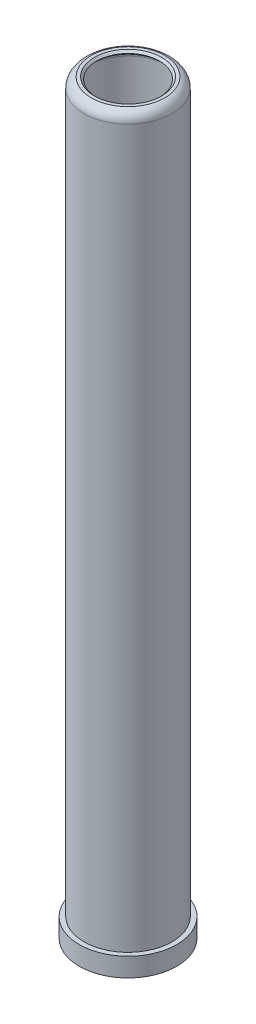
ISO-10303-21;
HEADER;
FILE_DESCRIPTION(('STEP AP214'),'2;1');
FILE_NAME('part.step','',(''),(''),'','','');
FILE_SCHEMA(('AUTOMOTIVE_DESIGN { 1 0 10303 214 1 1 1 1 }'));
ENDSEC;
DATA;
#1=APPLICATION_CONTEXT('core data for automotive mechanical design processes');
#2=APPLICATION_PROTOCOL_DEFINITION('international standard','automotive_design',2000,#1);
#3=PRODUCT_CONTEXT('',#1,'mechanical');
#4=PRODUCT('Part','Part','',(#3));
#5=PRODUCT_RELATED_PRODUCT_CATEGORY('part','',(#4));
#6=PRODUCT_DEFINITION_FORMATION('','',#4);
#7=PRODUCT_DEFINITION_CONTEXT('part definition',#1,'design');
#8=PRODUCT_DEFINITION('design','',#6,#7);
#9=PRODUCT_DEFINITION_SHAPE('','',#8);
#10=(LENGTH_UNIT() NAMED_UNIT(*) SI_UNIT(.MILLI.,.METRE.));
#11=(NAMED_UNIT(*) PLANE_ANGLE_UNIT() SI_UNIT($,.RADIAN.));
#12=(NAMED_UNIT(*) SI_UNIT($,.STERADIAN.) SOLID_ANGLE_UNIT());
#13=UNCERTAINTY_MEASURE_WITH_UNIT(LENGTH_MEASURE(1.E-05),#10,'distance_accuracy_value','');
#14=(GEOMETRIC_REPRESENTATION_CONTEXT(3) GLOBAL_UNCERTAINTY_ASSIGNED_CONTEXT((#13)) GLOBAL_UNIT_ASSIGNED_CONTEXT((#10,
#11,#12)) REPRESENTATION_CONTEXT('',''));
#15=CARTESIAN_POINT('',(0.,0.,0.));
#16=DIRECTION('',(0.,0.,1.));
#17=DIRECTION('',(1.,0.,0.));
#18=AXIS2_PLACEMENT_3D('',#15,#16,#17);
#19=CARTESIAN_POINT('',(-7.8236028766554E-13,227.966923076923,0.));
#20=DIRECTION('',(0.,-1.,0.));
#21=DIRECTION('',(1.,0.,0.));
#22=AXIS2_PLACEMENT_3D('',#19,#20,#21);
#23=TOROIDAL_SURFACE('',#22,10.6730769230779,1.82692307692295);
#24=CARTESIAN_POINT('',(-7.81983309663684E-13,227.966923076923,0.));
#25=DIRECTION('',(0.,-1.,0.));
#26=DIRECTION('',(1.,0.,0.));
#27=AXIS2_PLACEMENT_3D('',#24,#25,#26);
#28=CIRCLE('',#27,12.5000000000008);
#29=CARTESIAN_POINT('',(12.5,227.966923076923,0.));
#30=VERTEX_POINT('',#29);
#31=EDGE_CURVE('E10',#30,#30,#28,.T.);
#32=ORIENTED_EDGE('',*,*,#31,.T.);
#33=EDGE_LOOP('',(#32));
#34=FACE_BOUND('',#33,.T.);
#35=CARTESIAN_POINT('',(-7.88250110719342E-13,229.793846153846,0.));
#36=DIRECTION('',(0.,-1.,0.));
#37=DIRECTION('',(1.,0.,0.));
#38=AXIS2_PLACEMENT_3D('',#35,#36,#37);
#39=CIRCLE('',#38,10.6730769230779);
#40=CARTESIAN_POINT('',(10.6730769230772,229.793846153846,0.));
#41=VERTEX_POINT('',#40);
#42=EDGE_CURVE('E85',#41,#41,#39,.T.);
#43=ORIENTED_EDGE('',*,*,#42,.F.);
#44=EDGE_LOOP('',(#43));
#45=FACE_BOUND('',#44,.T.);
#46=ADVANCED_FACE('F36',(#34,#45),#23,.F.);
#47=CARTESIAN_POINT('',(3.72252080250057E-12,-1085.20425301771,0.));
#48=DIRECTION('',(0.,-1.,0.));
#49=DIRECTION('',(1.,0.,0.));
#50=AXIS2_PLACEMENT_3D('',#47,#48,#49);
#51=CYLINDRICAL_SURFACE('',#50,12.5000000000004);
#52=CARTESIAN_POINT('',(0.,6.9999999999999,0.));
#53=DIRECTION('',(0.,-1.,0.));
#54=DIRECTION('',(1.,0.,0.));
#55=AXIS2_PLACEMENT_3D('',#52,#53,#54);
#56=CIRCLE('',#55,12.5);
#57=CARTESIAN_POINT('',(12.5,6.99999999999994,0.));
#58=VERTEX_POINT('',#57);
#59=EDGE_CURVE('E42',#58,#58,#56,.T.);
#60=ORIENTED_EDGE('',*,*,#59,.T.);
#61=EDGE_LOOP('',(#60));
#62=FACE_BOUND('',#61,.T.);
#63=ORIENTED_EDGE('',*,*,#31,.F.);
#64=EDGE_LOOP('',(#63));
#65=FACE_BOUND('',#64,.T.);
#66=ADVANCED_FACE('F93',(#62,#65),#51,.F.);
#67=CARTESIAN_POINT('',(10.,6.99999999999999,0.));
#68=DIRECTION('',(0.,1.,0.));
#69=DIRECTION('',(-1.,0.,0.));
#70=AXIS2_PLACEMENT_3D('',#67,#68,#69);
#71=PLANE('',#70);
#72=CARTESIAN_POINT('',(0.,6.9999999999999,0.));
#73=DIRECTION('',(0.,-1.,0.));
#74=DIRECTION('',(1.,0.,0.));
#75=AXIS2_PLACEMENT_3D('',#72,#73,#74);
#76=CIRCLE('',#75,10.);
#77=CARTESIAN_POINT('',(10.,6.99999999999993,0.));
#78=VERTEX_POINT('',#77);
#79=EDGE_CURVE('E46',#78,#78,#76,.T.);
#80=ORIENTED_EDGE('',*,*,#79,.T.);
#81=EDGE_LOOP('',(#80));
#82=FACE_BOUND('',#81,.T.);
#83=ORIENTED_EDGE('',*,*,#59,.F.);
#84=EDGE_LOOP('',(#83));
#85=FACE_BOUND('',#84,.T.);
#86=ADVANCED_FACE('F97',(#82,#85),#71,.T.);
#87=CARTESIAN_POINT('',(3.72252080250057E-12,-1085.20425301771,0.));
#88=DIRECTION('',(0.,-1.,0.));
#89=DIRECTION('',(1.,0.,0.));
#90=AXIS2_PLACEMENT_3D('',#87,#88,#89);
#91=CYLINDRICAL_SURFACE('',#90,10.);
#92=CARTESIAN_POINT('',(0.,2.,0.));
#93=DIRECTION('',(0.,-1.,0.));
#94=DIRECTION('',(1.,0.,0.));
#95=AXIS2_PLACEMENT_3D('',#92,#93,#94);
#96=CIRCLE('',#95,10.);
#97=CARTESIAN_POINT('',(10.,2.00000000000004,0.));
#98=VERTEX_POINT('',#97);
#99=EDGE_CURVE('E50',#98,#98,#96,.T.);
#100=ORIENTED_EDGE('',*,*,#99,.T.);
#101=EDGE_LOOP('',(#100));
#102=FACE_BOUND('',#101,.T.);
#103=ORIENTED_EDGE('',*,*,#79,.F.);
#104=EDGE_LOOP('',(#103));
#105=FACE_BOUND('',#104,.T.);
#106=ADVANCED_FACE('F101',(#102,#105),#91,.F.);
#107=CARTESIAN_POINT('',(10.,2.,0.));
#108=DIRECTION('',(0.,-1.,0.));
#109=DIRECTION('',(1.,0.,0.));
#110=AXIS2_PLACEMENT_3D('',#107,#108,#109);
#111=PLANE('',#110);
#112=CARTESIAN_POINT('',(0.,2.,0.));
#113=DIRECTION('',(0.,-1.,0.));
#114=DIRECTION('',(1.,0.,0.));
#115=AXIS2_PLACEMENT_3D('',#112,#113,#114);
#116=CIRCLE('',#115,11.);
#117=CARTESIAN_POINT('',(11.,2.00000000000004,0.));
#118=VERTEX_POINT('',#117);
#119=EDGE_CURVE('E55',#118,#118,#116,.T.);
#120=ORIENTED_EDGE('',*,*,#119,.T.);
#121=EDGE_LOOP('',(#120));
#122=FACE_BOUND('',#121,.T.);
#123=ORIENTED_EDGE('',*,*,#99,.F.);
#124=EDGE_LOOP('',(#123));
#125=FACE_BOUND('',#124,.T.);
#126=ADVANCED_FACE('F108',(#122,#125),#111,.T.);
#127=CARTESIAN_POINT('',(3.72252080250057E-12,-1085.20425301771,0.));
#128=DIRECTION('',(0.,-1.,0.));
#129=DIRECTION('',(1.,0.,0.));
#130=AXIS2_PLACEMENT_3D('',#127,#128,#129);
#131=CYLINDRICAL_SURFACE('',#130,11.);
#132=CARTESIAN_POINT('',(0.,-0.99999999999989,0.));
#133=DIRECTION('',(0.,-1.,0.));
#134=DIRECTION('',(1.,0.,0.));
#135=AXIS2_PLACEMENT_3D('',#132,#133,#134);
#136=CIRCLE('',#135,11.);
#137=CARTESIAN_POINT('',(11.,-0.999999999999852,0.));
#138=VERTEX_POINT('',#137);
#139=EDGE_CURVE('E58',#138,#138,#136,.T.);
#140=ORIENTED_EDGE('',*,*,#139,.T.);
#141=EDGE_LOOP('',(#140));
#142=FACE_BOUND('',#141,.T.);
#143=ORIENTED_EDGE('',*,*,#119,.F.);
#144=EDGE_LOOP('',(#143));
#145=FACE_BOUND('',#144,.T.);
#146=ADVANCED_FACE('F112',(#142,#145),#131,.F.);
#147=CARTESIAN_POINT('',(0.,-6.,0.));
#148=DIRECTION('',(0.,-1.,0.));
#149=DIRECTION('',(1.,0.,0.));
#150=AXIS2_PLACEMENT_3D('',#147,#148,#149);
#151=TOROIDAL_SURFACE('',#150,9.17857142857141,5.32142857142857);
#152=CARTESIAN_POINT('',(0.,-6.00000000000001,0.));
#153=DIRECTION('',(0.,-1.,0.));
#154=DIRECTION('',(1.,0.,0.));
#155=AXIS2_PLACEMENT_3D('',#152,#153,#154);
#156=CIRCLE('',#155,14.5);
#157=CARTESIAN_POINT('',(14.5,-5.99999999999996,0.));
#158=VERTEX_POINT('',#157);
#159=EDGE_CURVE('E61',#158,#158,#156,.T.);
#160=ORIENTED_EDGE('',*,*,#159,.T.);
#161=EDGE_LOOP('',(#160));
#162=FACE_BOUND('',#161,.T.);
#163=ORIENTED_EDGE('',*,*,#139,.F.);
#164=EDGE_LOOP('',(#163));
#165=FACE_BOUND('',#164,.T.);
#166=ADVANCED_FACE('F116',(#162,#165),#151,.F.);
#167=CARTESIAN_POINT('',(15.5,-6.,0.));
#168=DIRECTION('',(0.,-1.,0.));
#169=DIRECTION('',(1.,0.,0.));
#170=AXIS2_PLACEMENT_3D('',#167,#168,#169);
#171=PLANE('',#170);
#172=CARTESIAN_POINT('',(0.,-6.00000000000001,0.));
#173=DIRECTION('',(0.,-1.,0.));
#174=DIRECTION('',(1.,0.,0.));
#175=AXIS2_PLACEMENT_3D('',#172,#173,#174);
#176=CIRCLE('',#175,15.5);
#177=CARTESIAN_POINT('',(15.5,-5.99999999999995,0.));
#178=VERTEX_POINT('',#177);
#179=EDGE_CURVE('E64',#178,#178,#176,.T.);
#180=ORIENTED_EDGE('',*,*,#179,.T.);
#181=EDGE_LOOP('',(#180));
#182=FACE_BOUND('',#181,.T.);
#183=ORIENTED_EDGE('',*,*,#159,.F.);
#184=EDGE_LOOP('',(#183));
#185=FACE_BOUND('',#184,.T.);
#186=ADVANCED_FACE('F120',(#182,#185),#171,.T.);
#187=CARTESIAN_POINT('',(3.72252080250057E-12,-1085.20425301771,0.));
#188=DIRECTION('',(0.,-1.,0.));
#189=DIRECTION('',(1.,0.,0.));
#190=AXIS2_PLACEMENT_3D('',#187,#188,#189);
#191=CYLINDRICAL_SURFACE('',#190,15.5);
#192=CARTESIAN_POINT('',(0.,0.,0.));
#193=DIRECTION('',(0.,-1.,0.));
#194=DIRECTION('',(1.,0.,0.));
#195=AXIS2_PLACEMENT_3D('',#192,#193,#194);
#196=CIRCLE('',#195,15.5);
#197=CARTESIAN_POINT('',(15.5,0.,0.));
#198=VERTEX_POINT('',#197);
#199=EDGE_CURVE('E67',#198,#198,#196,.T.);
#200=ORIENTED_EDGE('',*,*,#199,.T.);
#201=EDGE_LOOP('',(#200));
#202=FACE_BOUND('',#201,.T.);
#203=ORIENTED_EDGE('',*,*,#179,.F.);
#204=EDGE_LOOP('',(#203));
#205=FACE_BOUND('',#204,.T.);
#206=ADVANCED_FACE('F124',(#202,#205),#191,.T.);
#207=CARTESIAN_POINT('',(14.,0.,0.));
#208=DIRECTION('',(0.,1.,0.));
#209=DIRECTION('',(-1.,0.,0.));
#210=AXIS2_PLACEMENT_3D('',#207,#208,#209);
#211=PLANE('',#210);
#212=CARTESIAN_POINT('',(0.,0.,0.));
#213=DIRECTION('',(0.,-1.,0.));
#214=DIRECTION('',(1.,0.,0.));
#215=AXIS2_PLACEMENT_3D('',#212,#213,#214);
#216=CIRCLE('',#215,14.);
#217=CARTESIAN_POINT('',(14.,0.,0.));
#218=VERTEX_POINT('',#217);
#219=EDGE_CURVE('E70',#218,#218,#216,.T.);
#220=ORIENTED_EDGE('',*,*,#219,.T.);
#221=EDGE_LOOP('',(#220));
#222=FACE_BOUND('',#221,.T.);
#223=ORIENTED_EDGE('',*,*,#199,.F.);
#224=EDGE_LOOP('',(#223));
#225=FACE_BOUND('',#224,.T.);
#226=ADVANCED_FACE('F128',(#222,#225),#211,.T.);
#227=CARTESIAN_POINT('',(3.72252080250057E-12,-1085.20425301771,0.));
#228=DIRECTION('',(0.,-1.,0.));
#229=DIRECTION('',(1.,0.,0.));
#230=AXIS2_PLACEMENT_3D('',#227,#228,#229);
#231=CYLINDRICAL_SURFACE('',#230,14.0000000000005);
#232=CARTESIAN_POINT('',(-7.81983309663684E-13,227.966923076923,0.));
#233=DIRECTION('',(0.,-1.,0.));
#234=DIRECTION('',(1.,0.,0.));
#235=AXIS2_PLACEMENT_3D('',#232,#233,#234);
#236=CIRCLE('',#235,14.000000000001);
#237=CARTESIAN_POINT('',(14.0000000000002,227.966923076923,0.));
#238=VERTEX_POINT('',#237);
#239=EDGE_CURVE('E73',#238,#238,#236,.T.);
#240=ORIENTED_EDGE('',*,*,#239,.T.);
#241=EDGE_LOOP('',(#240));
#242=FACE_BOUND('',#241,.T.);
#243=ORIENTED_EDGE('',*,*,#219,.F.);
#244=EDGE_LOOP('',(#243));
#245=FACE_BOUND('',#244,.T.);
#246=ADVANCED_FACE('F132',(#242,#245),#231,.T.);
#247=CARTESIAN_POINT('',(-7.8236028766554E-13,227.966923076923,0.));
#248=DIRECTION('',(0.,-1.,0.));
#249=DIRECTION('',(1.,0.,0.));
#250=AXIS2_PLACEMENT_3D('',#247,#248,#249);
#251=TOROIDAL_SURFACE('',#250,10.6730769230779,3.32692307692306);
#252=CARTESIAN_POINT('',(-7.92867753602457E-13,231.14,0.));
#253=DIRECTION('',(0.,-1.,0.));
#254=DIRECTION('',(1.,0.,0.));
#255=AXIS2_PLACEMENT_3D('',#252,#253,#254);
#256=CIRCLE('',#255,11.673076923078);
#257=CARTESIAN_POINT('',(11.6730769230772,231.14,0.));
#258=VERTEX_POINT('',#257);
#259=EDGE_CURVE('E76',#258,#258,#256,.T.);
#260=ORIENTED_EDGE('',*,*,#259,.T.);
#261=EDGE_LOOP('',(#260));
#262=FACE_BOUND('',#261,.T.);
#263=ORIENTED_EDGE('',*,*,#239,.F.);
#264=EDGE_LOOP('',(#263));
#265=FACE_BOUND('',#264,.T.);
#266=ADVANCED_FACE('F136',(#262,#265),#251,.T.);
#267=CARTESIAN_POINT('',(10.6730769230772,231.14,0.));
#268=DIRECTION('',(0.,1.,0.));
#269=DIRECTION('',(-1.,0.,0.));
#270=AXIS2_PLACEMENT_3D('',#267,#268,#269);
#271=PLANE('',#270);
#272=CARTESIAN_POINT('',(-7.92867753602457E-13,231.14,0.));
#273=DIRECTION('',(0.,-1.,0.));
#274=DIRECTION('',(1.,0.,0.));
#275=AXIS2_PLACEMENT_3D('',#272,#273,#274);
#276=CIRCLE('',#275,10.673076923078);
#277=CARTESIAN_POINT('',(10.6730769230772,231.14,0.));
#278=VERTEX_POINT('',#277);
#279=EDGE_CURVE('E79',#278,#278,#276,.T.);
#280=ORIENTED_EDGE('',*,*,#279,.T.);
#281=EDGE_LOOP('',(#280));
#282=FACE_BOUND('',#281,.T.);
#283=ORIENTED_EDGE('',*,*,#259,.F.);
#284=EDGE_LOOP('',(#283));
#285=FACE_BOUND('',#284,.T.);
#286=ADVANCED_FACE('F140',(#282,#285),#271,.T.);
#287=CARTESIAN_POINT('',(-7.92867753602457E-13,231.14,0.));
#288=DIRECTION('',(0.,1.,0.));
#289=DIRECTION('',(-1.,0.,0.));
#290=AXIS2_PLACEMENT_3D('',#287,#288,#289);
#291=CONICAL_SURFACE('',#290,10.673076923078,0.785398163397435);
#292=CARTESIAN_POINT('',(-7.90558932160899E-13,230.466923076923,0.));
#293=DIRECTION('',(0.,-1.,0.));
#294=DIRECTION('',(1.,0.,0.));
#295=AXIS2_PLACEMENT_3D('',#292,#293,#294);
#296=CIRCLE('',#295,10.000000000001);
#297=CARTESIAN_POINT('',(10.0000000000002,230.466923076923,0.));
#298=VERTEX_POINT('',#297);
#299=EDGE_CURVE('E82',#298,#298,#296,.T.);
#300=ORIENTED_EDGE('',*,*,#299,.T.);
#301=EDGE_LOOP('',(#300));
#302=FACE_BOUND('',#301,.T.);
#303=ORIENTED_EDGE('',*,*,#279,.F.);
#304=EDGE_LOOP('',(#303));
#305=FACE_BOUND('',#304,.T.);
#306=ADVANCED_FACE('F144',(#302,#305),#291,.F.);
#307=CARTESIAN_POINT('',(-7.90558932160899E-13,230.466923076923,0.));
#308=DIRECTION('',(0.,-1.,0.));
#309=DIRECTION('',(1.,0.,0.));
#310=AXIS2_PLACEMENT_3D('',#307,#308,#309);
#311=CONICAL_SURFACE('',#310,10.000000000001,0.785398163397596);
#312=ORIENTED_EDGE('',*,*,#42,.T.);
#313=EDGE_LOOP('',(#312));
#314=FACE_BOUND('',#313,.T.);
#315=ORIENTED_EDGE('',*,*,#299,.F.);
#316=EDGE_LOOP('',(#315));
#317=FACE_BOUND('',#316,.T.);
#318=ADVANCED_FACE('F89',(#314,#317),#311,.F.);
#319=CLOSED_SHELL('',(#46,#66,#86,#106,#126,#146,#166,#186,#206,#226,#246,#266,#286,#306,#318));
#320=MANIFOLD_SOLID_BREP('B2',#319);
#321=ADVANCED_BREP_SHAPE_REPRESENTATION('',(#18,#320),#14);
#322=SHAPE_DEFINITION_REPRESENTATION(#9,#321);
ENDSEC;
END-ISO-10303-21;
